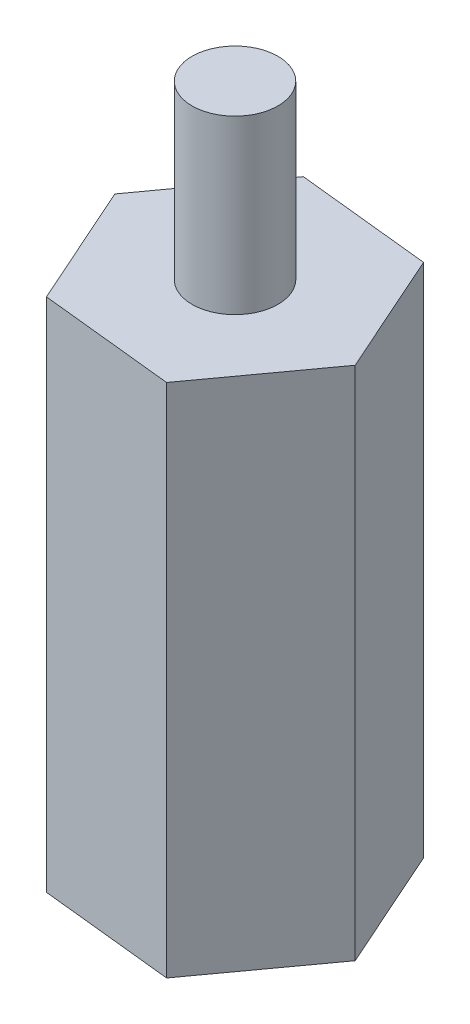
ISO-10303-21;
HEADER;
FILE_DESCRIPTION(('STEP AP214'),'2;1');
FILE_NAME('part.step','',(''),(''),'','','');
FILE_SCHEMA(('AUTOMOTIVE_DESIGN { 1 0 10303 214 1 1 1 1 }'));
ENDSEC;
DATA;
#1=APPLICATION_CONTEXT('core data for automotive mechanical design processes');
#2=APPLICATION_PROTOCOL_DEFINITION('international standard','automotive_design',2000,#1);
#3=PRODUCT_CONTEXT('',#1,'mechanical');
#4=PRODUCT('Part','Part','',(#3));
#5=PRODUCT_RELATED_PRODUCT_CATEGORY('part','',(#4));
#6=PRODUCT_DEFINITION_FORMATION('','',#4);
#7=PRODUCT_DEFINITION_CONTEXT('part definition',#1,'design');
#8=PRODUCT_DEFINITION('design','',#6,#7);
#9=PRODUCT_DEFINITION_SHAPE('','',#8);
#10=(LENGTH_UNIT() NAMED_UNIT(*) SI_UNIT(.MILLI.,.METRE.));
#11=(NAMED_UNIT(*) PLANE_ANGLE_UNIT() SI_UNIT($,.RADIAN.));
#12=(NAMED_UNIT(*) SI_UNIT($,.STERADIAN.) SOLID_ANGLE_UNIT());
#13=UNCERTAINTY_MEASURE_WITH_UNIT(LENGTH_MEASURE(1.E-05),#10,'distance_accuracy_value','');
#14=(GEOMETRIC_REPRESENTATION_CONTEXT(3) GLOBAL_UNCERTAINTY_ASSIGNED_CONTEXT((#13)) GLOBAL_UNIT_ASSIGNED_CONTEXT((#10,
#11,#12)) REPRESENTATION_CONTEXT('',''));
#15=CARTESIAN_POINT('',(0.,0.,0.));
#16=DIRECTION('',(0.,0.,1.));
#17=DIRECTION('',(1.,0.,0.));
#18=AXIS2_PLACEMENT_3D('',#15,#16,#17);
#19=CARTESIAN_POINT('',(0.,20.,0.));
#20=DIRECTION('',(0.,-1.,0.));
#21=DIRECTION('',(0.,0.,-1.));
#22=AXIS2_PLACEMENT_3D('',#19,#20,#21);
#23=CYLINDRICAL_SURFACE('',#22,1.25);
#24=CARTESIAN_POINT('',(0.,20.,0.));
#25=DIRECTION('',(0.,1.,0.));
#26=DIRECTION('',(0.,0.,1.));
#27=AXIS2_PLACEMENT_3D('',#24,#25,#26);
#28=CIRCLE('',#27,1.25);
#29=CARTESIAN_POINT('',(0.,20.,1.25));
#30=VERTEX_POINT('',#29);
#31=EDGE_CURVE('E11',#30,#30,#28,.T.);
#32=ORIENTED_EDGE('',*,*,#31,.F.);
#33=EDGE_LOOP('',(#32));
#34=FACE_BOUND('',#33,.T.);
#35=CARTESIAN_POINT('',(0.,15.,0.));
#36=DIRECTION('',(0.,1.,0.));
#37=DIRECTION('',(0.,0.,1.));
#38=AXIS2_PLACEMENT_3D('',#35,#36,#37);
#39=CIRCLE('',#38,1.25);
#40=CARTESIAN_POINT('',(0.,15.,1.25));
#41=VERTEX_POINT('',#40);
#42=EDGE_CURVE('E46',#41,#41,#39,.T.);
#43=ORIENTED_EDGE('',*,*,#42,.T.);
#44=EDGE_LOOP('',(#43));
#45=FACE_BOUND('',#44,.T.);
#46=ADVANCED_FACE('F43',(#34,#45),#23,.T.);
#47=CARTESIAN_POINT('',(0.,20.,0.));
#48=DIRECTION('',(0.,1.,0.));
#49=DIRECTION('',(0.,0.,1.));
#50=AXIS2_PLACEMENT_3D('',#47,#48,#49);
#51=PLANE('',#50);
#52=ORIENTED_EDGE('',*,*,#31,.T.);
#53=EDGE_LOOP('',(#52));
#54=FACE_BOUND('',#53,.T.);
#55=ADVANCED_FACE('F58',(#54),#51,.T.);
#56=CARTESIAN_POINT('',(0.,15.,0.));
#57=DIRECTION('',(0.,1.,0.));
#58=DIRECTION('',(0.,0.,1.));
#59=AXIS2_PLACEMENT_3D('',#56,#57,#58);
#60=PLANE('',#59);
#61=ORIENTED_EDGE('',*,*,#42,.F.);
#62=EDGE_LOOP('',(#61));
#63=FACE_BOUND('',#62,.T.);
#64=ADVANCED_FACE('F56',(#63),#60,.F.);
#65=CLOSED_SHELL('',(#46,#55,#64));
#66=MANIFOLD_SOLID_BREP('B2',#65);
#67=CARTESIAN_POINT('',(0.,15.,0.));
#68=DIRECTION('',(0.,1.,0.));
#69=DIRECTION('',(0.,0.,1.));
#70=AXIS2_PLACEMENT_3D('',#67,#68,#69);
#71=PLANE('',#70);
#72=DIRECTION('',(-0.406856126186864,0.,-0.913492250971084));
#73=VECTOR('',#72,1.);
#74=CARTESIAN_POINT('',(3.90469353861305,15.,0.409883481755304));
#75=LINE('',#74,#73);
#76=CARTESIAN_POINT('',(3.90469353861305,15.,0.409883481755304));
#77=VERTEX_POINT('',#76);
#78=CARTESIAN_POINT('',(2.30731627709823,15.,-3.1766220575542));
#79=VERTEX_POINT('',#78);
#80=EDGE_CURVE('E179',#77,#79,#75,.T.);
#81=ORIENTED_EDGE('',*,*,#80,.T.);
#82=DIRECTION('',(-0.994535558594621,0.,-0.104398384522391));
#83=VECTOR('',#82,1.);
#84=CARTESIAN_POINT('',(2.30731627709823,15.,-3.1766220575542));
#85=LINE('',#84,#83);
#86=CARTESIAN_POINT('',(-1.59737726151481,15.,-3.58650553930951));
#87=VERTEX_POINT('',#86);
#88=EDGE_CURVE('E137',#79,#87,#85,.T.);
#89=ORIENTED_EDGE('',*,*,#88,.T.);
#90=DIRECTION('',(-0.587679432407757,0.,0.809093866448694));
#91=VECTOR('',#90,1.);
#92=CARTESIAN_POINT('',(-1.59737726151481,15.,-3.58650553930951));
#93=LINE('',#92,#91);
#94=CARTESIAN_POINT('',(-3.90469353861305,15.,-0.409883481755304));
#95=VERTEX_POINT('',#94);
#96=EDGE_CURVE('E150',#87,#95,#93,.T.);
#97=ORIENTED_EDGE('',*,*,#96,.T.);
#98=DIRECTION('',(0.406856126186864,0.,0.913492250971084));
#99=VECTOR('',#98,1.);
#100=CARTESIAN_POINT('',(-3.90469353861305,15.,-0.409883481755304));
#101=LINE('',#100,#99);
#102=CARTESIAN_POINT('',(-2.30731627709823,15.,3.1766220575542));
#103=VERTEX_POINT('',#102);
#104=EDGE_CURVE('E144',#95,#103,#101,.T.);
#105=ORIENTED_EDGE('',*,*,#104,.T.);
#106=DIRECTION('',(0.994535558594621,0.,0.104398384522391));
#107=VECTOR('',#106,1.);
#108=CARTESIAN_POINT('',(-2.30731627709823,15.,3.1766220575542));
#109=LINE('',#108,#107);
#110=CARTESIAN_POINT('',(1.59737726151482,15.,3.58650553930951));
#111=VERTEX_POINT('',#110);
#112=EDGE_CURVE('E148',#103,#111,#109,.T.);
#113=ORIENTED_EDGE('',*,*,#112,.T.);
#114=DIRECTION('',(0.587679432407757,0.,-0.809093866448694));
#115=VECTOR('',#114,1.);
#116=CARTESIAN_POINT('',(1.59737726151482,15.,3.58650553930951));
#117=LINE('',#116,#115);
#118=EDGE_CURVE('E100',#111,#77,#117,.T.);
#119=ORIENTED_EDGE('',*,*,#118,.T.);
#120=EDGE_LOOP('',(#81,#89,#97,#105,#113,#119));
#121=FACE_BOUND('',#120,.T.);
#122=CARTESIAN_POINT('',(0.,15.,0.));
#123=DIRECTION('',(0.,1.,0.));
#124=DIRECTION('',(0.,0.,1.));
#125=AXIS2_PLACEMENT_3D('',#122,#123,#124);
#126=CIRCLE('',#125,1.25);
#127=CARTESIAN_POINT('',(0.,15.,1.25));
#128=VERTEX_POINT('',#127);
#129=EDGE_CURVE('E172',#128,#128,#126,.T.);
#130=ORIENTED_EDGE('',*,*,#129,.F.);
#131=EDGE_LOOP('',(#130));
#132=FACE_BOUND('',#131,.T.);
#133=ADVANCED_FACE('F83',(#121,#132),#71,.T.);
#134=CARTESIAN_POINT('',(0.,0.,0.));
#135=DIRECTION('',(0.,1.,0.));
#136=DIRECTION('',(0.,0.,1.));
#137=AXIS2_PLACEMENT_3D('',#134,#135,#136);
#138=PLANE('',#137);
#139=DIRECTION('',(-0.406856126186864,0.,-0.913492250971084));
#140=VECTOR('',#139,1.);
#141=CARTESIAN_POINT('',(3.90469353861305,0.,0.409883481755304));
#142=LINE('',#141,#140);
#143=CARTESIAN_POINT('',(3.90469353861305,0.,0.409883481755304));
#144=VERTEX_POINT('',#143);
#145=CARTESIAN_POINT('',(2.30731627709823,0.,-3.1766220575542));
#146=VERTEX_POINT('',#145);
#147=EDGE_CURVE('E168',#144,#146,#142,.T.);
#148=ORIENTED_EDGE('',*,*,#147,.F.);
#149=DIRECTION('',(0.587679432407757,0.,-0.809093866448694));
#150=VECTOR('',#149,1.);
#151=CARTESIAN_POINT('',(1.59737726151482,0.,3.58650553930951));
#152=LINE('',#151,#150);
#153=CARTESIAN_POINT('',(1.59737726151482,0.,3.58650553930951));
#154=VERTEX_POINT('',#153);
#155=EDGE_CURVE('E129',#154,#144,#152,.T.);
#156=ORIENTED_EDGE('',*,*,#155,.F.);
#157=DIRECTION('',(0.994535558594621,0.,0.104398384522391));
#158=VECTOR('',#157,1.);
#159=CARTESIAN_POINT('',(-2.30731627709823,0.,3.1766220575542));
#160=LINE('',#159,#158);
#161=CARTESIAN_POINT('',(-2.30731627709823,0.,3.1766220575542));
#162=VERTEX_POINT('',#161);
#163=EDGE_CURVE('E123',#162,#154,#160,.T.);
#164=ORIENTED_EDGE('',*,*,#163,.F.);
#165=DIRECTION('',(0.406856126186864,0.,0.913492250971084));
#166=VECTOR('',#165,1.);
#167=CARTESIAN_POINT('',(-3.90469353861305,0.,-0.409883481755304));
#168=LINE('',#167,#166);
#169=CARTESIAN_POINT('',(-3.90469353861305,0.,-0.409883481755304));
#170=VERTEX_POINT('',#169);
#171=EDGE_CURVE('E158',#170,#162,#168,.T.);
#172=ORIENTED_EDGE('',*,*,#171,.F.);
#173=DIRECTION('',(-0.587679432407757,0.,0.809093866448694));
#174=VECTOR('',#173,1.);
#175=CARTESIAN_POINT('',(-1.59737726151481,0.,-3.58650553930951));
#176=LINE('',#175,#174);
#177=CARTESIAN_POINT('',(-1.59737726151481,0.,-3.58650553930951));
#178=VERTEX_POINT('',#177);
#179=EDGE_CURVE('E174',#178,#170,#176,.T.);
#180=ORIENTED_EDGE('',*,*,#179,.F.);
#181=DIRECTION('',(-0.994535558594621,0.,-0.104398384522391));
#182=VECTOR('',#181,1.);
#183=CARTESIAN_POINT('',(2.30731627709823,0.,-3.1766220575542));
#184=LINE('',#183,#182);
#185=EDGE_CURVE('E171',#146,#178,#184,.T.);
#186=ORIENTED_EDGE('',*,*,#185,.F.);
#187=EDGE_LOOP('',(#148,#156,#164,#172,#180,#186));
#188=FACE_BOUND('',#187,.T.);
#189=CARTESIAN_POINT('',(0.,0.,0.));
#190=DIRECTION('',(0.,1.,0.));
#191=DIRECTION('',(0.,0.,1.));
#192=AXIS2_PLACEMENT_3D('',#189,#190,#191);
#193=CIRCLE('',#192,1.25);
#194=CARTESIAN_POINT('',(0.,0.,1.25));
#195=VERTEX_POINT('',#194);
#196=EDGE_CURVE('E272',#195,#195,#193,.T.);
#197=ORIENTED_EDGE('',*,*,#196,.T.);
#198=EDGE_LOOP('',(#197));
#199=FACE_BOUND('',#198,.T.);
#200=ADVANCED_FACE('F188',(#188,#199),#138,.F.);
#201=CARTESIAN_POINT('',(3.90469353861305,15.,0.409883481755304));
#202=DIRECTION('',(-0.913492250971084,0.,0.406856126186864));
#203=DIRECTION('',(0.406856126186864,0.,0.913492250971084));
#204=AXIS2_PLACEMENT_3D('',#201,#202,#203);
#205=PLANE('',#204);
#206=ORIENTED_EDGE('',*,*,#147,.T.);
#207=DIRECTION('',(0.,-1.,0.));
#208=VECTOR('',#207,1.);
#209=CARTESIAN_POINT('',(2.30731627709823,15.,-3.1766220575542));
#210=LINE('',#209,#208);
#211=EDGE_CURVE('E41',#79,#146,#210,.T.);
#212=ORIENTED_EDGE('',*,*,#211,.F.);
#213=ORIENTED_EDGE('',*,*,#80,.F.);
#214=DIRECTION('',(0.,-1.,0.));
#215=VECTOR('',#214,1.);
#216=CARTESIAN_POINT('',(3.90469353861305,15.,0.409883481755304));
#217=LINE('',#216,#215);
#218=EDGE_CURVE('E164',#77,#144,#217,.T.);
#219=ORIENTED_EDGE('',*,*,#218,.T.);
#220=EDGE_LOOP('',(#206,#212,#213,#219));
#221=FACE_BOUND('',#220,.T.);
#222=ADVANCED_FACE('F85',(#221),#205,.F.);
#223=CARTESIAN_POINT('',(2.30731627709823,15.,-3.1766220575542));
#224=DIRECTION('',(-0.104398384522391,0.,0.994535558594621));
#225=DIRECTION('',(0.994535558594621,0.,0.104398384522391));
#226=AXIS2_PLACEMENT_3D('',#223,#224,#225);
#227=PLANE('',#226);
#228=ORIENTED_EDGE('',*,*,#185,.T.);
#229=DIRECTION('',(0.,-1.,0.));
#230=VECTOR('',#229,1.);
#231=CARTESIAN_POINT('',(-1.59737726151481,15.,-3.58650553930951));
#232=LINE('',#231,#230);
#233=EDGE_CURVE('E92',#87,#178,#232,.T.);
#234=ORIENTED_EDGE('',*,*,#233,.F.);
#235=ORIENTED_EDGE('',*,*,#88,.F.);
#236=ORIENTED_EDGE('',*,*,#211,.T.);
#237=EDGE_LOOP('',(#228,#234,#235,#236));
#238=FACE_BOUND('',#237,.T.);
#239=ADVANCED_FACE('F213',(#238),#227,.F.);
#240=CARTESIAN_POINT('',(-1.59737726151481,15.,-3.58650553930951));
#241=DIRECTION('',(0.809093866448694,0.,0.587679432407757));
#242=DIRECTION('',(0.587679432407757,0.,-0.809093866448694));
#243=AXIS2_PLACEMENT_3D('',#240,#241,#242);
#244=PLANE('',#243);
#245=ORIENTED_EDGE('',*,*,#179,.T.);
#246=DIRECTION('',(0.,-1.,0.));
#247=VECTOR('',#246,1.);
#248=CARTESIAN_POINT('',(-3.90469353861305,15.,-0.409883481755304));
#249=LINE('',#248,#247);
#250=EDGE_CURVE('E159',#95,#170,#249,.T.);
#251=ORIENTED_EDGE('',*,*,#250,.F.);
#252=ORIENTED_EDGE('',*,*,#96,.F.);
#253=ORIENTED_EDGE('',*,*,#233,.T.);
#254=EDGE_LOOP('',(#245,#251,#252,#253));
#255=FACE_BOUND('',#254,.T.);
#256=ADVANCED_FACE('F185',(#255),#244,.F.);
#257=CARTESIAN_POINT('',(-3.90469353861305,15.,-0.409883481755304));
#258=DIRECTION('',(0.913492250971084,0.,-0.406856126186864));
#259=DIRECTION('',(-0.406856126186864,0.,-0.913492250971085));
#260=AXIS2_PLACEMENT_3D('',#257,#258,#259);
#261=PLANE('',#260);
#262=ORIENTED_EDGE('',*,*,#171,.T.);
#263=DIRECTION('',(0.,-1.,0.));
#264=VECTOR('',#263,1.);
#265=CARTESIAN_POINT('',(-2.30731627709823,15.,3.1766220575542));
#266=LINE('',#265,#264);
#267=EDGE_CURVE('E155',#103,#162,#266,.T.);
#268=ORIENTED_EDGE('',*,*,#267,.F.);
#269=ORIENTED_EDGE('',*,*,#104,.F.);
#270=ORIENTED_EDGE('',*,*,#250,.T.);
#271=EDGE_LOOP('',(#262,#268,#269,#270));
#272=FACE_BOUND('',#271,.T.);
#273=ADVANCED_FACE('F156',(#272),#261,.F.);
#274=CARTESIAN_POINT('',(-2.30731627709823,15.,3.1766220575542));
#275=DIRECTION('',(0.104398384522391,0.,-0.994535558594621));
#276=DIRECTION('',(-0.994535558594621,0.,-0.104398384522391));
#277=AXIS2_PLACEMENT_3D('',#274,#275,#276);
#278=PLANE('',#277);
#279=ORIENTED_EDGE('',*,*,#163,.T.);
#280=DIRECTION('',(0.,-1.,0.));
#281=VECTOR('',#280,1.);
#282=CARTESIAN_POINT('',(1.59737726151482,15.,3.58650553930951));
#283=LINE('',#282,#281);
#284=EDGE_CURVE('E160',#111,#154,#283,.T.);
#285=ORIENTED_EDGE('',*,*,#284,.F.);
#286=ORIENTED_EDGE('',*,*,#112,.F.);
#287=ORIENTED_EDGE('',*,*,#267,.T.);
#288=EDGE_LOOP('',(#279,#285,#286,#287));
#289=FACE_BOUND('',#288,.T.);
#290=ADVANCED_FACE('F162',(#289),#278,.F.);
#291=CARTESIAN_POINT('',(1.59737726151482,15.,3.58650553930951));
#292=DIRECTION('',(-0.809093866448694,0.,-0.587679432407757));
#293=DIRECTION('',(-0.587679432407757,0.,0.809093866448694));
#294=AXIS2_PLACEMENT_3D('',#291,#292,#293);
#295=PLANE('',#294);
#296=ORIENTED_EDGE('',*,*,#155,.T.);
#297=ORIENTED_EDGE('',*,*,#218,.F.);
#298=ORIENTED_EDGE('',*,*,#118,.F.);
#299=ORIENTED_EDGE('',*,*,#284,.T.);
#300=EDGE_LOOP('',(#296,#297,#298,#299));
#301=FACE_BOUND('',#300,.T.);
#302=ADVANCED_FACE('F193',(#301),#295,.F.);
#303=CARTESIAN_POINT('',(0.,15.,0.));
#304=DIRECTION('',(0.,-1.,0.));
#305=DIRECTION('',(0.,0.,-1.));
#306=AXIS2_PLACEMENT_3D('',#303,#304,#305);
#307=CYLINDRICAL_SURFACE('',#306,1.25);
#308=ORIENTED_EDGE('',*,*,#129,.T.);
#309=EDGE_LOOP('',(#308));
#310=FACE_BOUND('',#309,.T.);
#311=ORIENTED_EDGE('',*,*,#196,.F.);
#312=EDGE_LOOP('',(#311));
#313=FACE_BOUND('',#312,.T.);
#314=ADVANCED_FACE('F195',(#310,#313),#307,.F.);
#315=CLOSED_SHELL('',(#133,#200,#222,#239,#256,#273,#290,#302,#314));
#316=MANIFOLD_SOLID_BREP('B6',#315);
#317=ADVANCED_BREP_SHAPE_REPRESENTATION('',(#18,#66,#316),#14);
#318=SHAPE_DEFINITION_REPRESENTATION(#9,#317);
ENDSEC;
END-ISO-10303-21;
